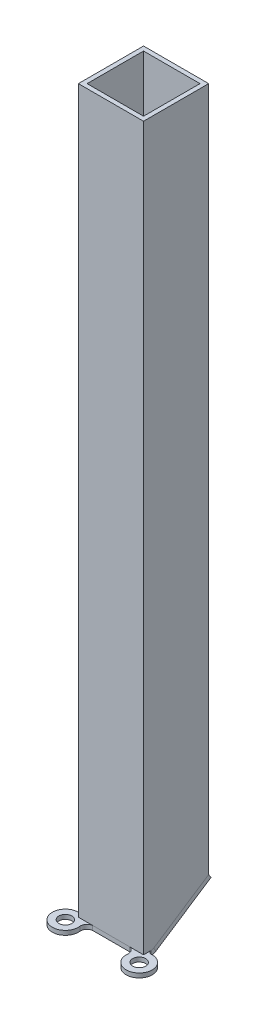
ISO-10303-21;
HEADER;
FILE_DESCRIPTION(('STEP AP214'),'2;1');
FILE_NAME('part.step','',(''),(''),'','','');
FILE_SCHEMA(('AUTOMOTIVE_DESIGN { 1 0 10303 214 1 1 1 1 }'));
ENDSEC;
DATA;
#1=APPLICATION_CONTEXT('core data for automotive mechanical design processes');
#2=APPLICATION_PROTOCOL_DEFINITION('international standard','automotive_design',2000,#1);
#3=PRODUCT_CONTEXT('',#1,'mechanical');
#4=PRODUCT('Part','Part','',(#3));
#5=PRODUCT_RELATED_PRODUCT_CATEGORY('part','',(#4));
#6=PRODUCT_DEFINITION_FORMATION('','',#4);
#7=PRODUCT_DEFINITION_CONTEXT('part definition',#1,'design');
#8=PRODUCT_DEFINITION('design','',#6,#7);
#9=PRODUCT_DEFINITION_SHAPE('','',#8);
#10=(LENGTH_UNIT() NAMED_UNIT(*) SI_UNIT(.MILLI.,.METRE.));
#11=(NAMED_UNIT(*) PLANE_ANGLE_UNIT() SI_UNIT($,.RADIAN.));
#12=(NAMED_UNIT(*) SI_UNIT($,.STERADIAN.) SOLID_ANGLE_UNIT());
#13=UNCERTAINTY_MEASURE_WITH_UNIT(LENGTH_MEASURE(1.E-05),#10,'distance_accuracy_value','');
#14=(GEOMETRIC_REPRESENTATION_CONTEXT(3) GLOBAL_UNCERTAINTY_ASSIGNED_CONTEXT((#13)) GLOBAL_UNIT_ASSIGNED_CONTEXT((#10,
#11,#12)) REPRESENTATION_CONTEXT('',''));
#15=CARTESIAN_POINT('',(0.,0.,0.));
#16=DIRECTION('',(0.,0.,1.));
#17=DIRECTION('',(1.,0.,0.));
#18=AXIS2_PLACEMENT_3D('',#15,#16,#17);
#19=CARTESIAN_POINT('',(1005.,-334.43981096134,434.283231707318));
#20=DIRECTION('',(0.,0.,1.));
#21=DIRECTION('',(1.,0.,0.));
#22=AXIS2_PLACEMENT_3D('',#19,#20,#21);
#23=PLANE('',#22);
#24=DIRECTION('',(1.,0.,0.));
#25=VECTOR('',#24,1.);
#26=CARTESIAN_POINT('',(1005.,-332.43981096134,434.283231707318));
#27=LINE('',#26,#25);
#28=CARTESIAN_POINT('',(1011.5,-332.43981096134,434.283231707318));
#29=VERTEX_POINT('',#28);
#30=CARTESIAN_POINT('',(1028.5,-332.43981096134,434.283231707318));
#31=VERTEX_POINT('',#30);
#32=EDGE_CURVE('E145',#29,#31,#27,.T.);
#33=ORIENTED_EDGE('',*,*,#32,.F.);
#34=DIRECTION('',(0.,-1.,0.));
#35=VECTOR('',#34,1.);
#36=CARTESIAN_POINT('',(1011.5,-332.43981096134,434.283231707318));
#37=LINE('',#36,#35);
#38=CARTESIAN_POINT('',(1011.5,-334.43981096134,434.283231707318));
#39=VERTEX_POINT('',#38);
#40=EDGE_CURVE('E309',#29,#39,#37,.T.);
#41=ORIENTED_EDGE('',*,*,#40,.T.);
#42=DIRECTION('',(1.,0.,0.));
#43=VECTOR('',#42,1.);
#44=CARTESIAN_POINT('',(1005.,-334.43981096134,434.283231707318));
#45=LINE('',#44,#43);
#46=CARTESIAN_POINT('',(1028.5,-334.43981096134,434.283231707318));
#47=VERTEX_POINT('',#46);
#48=EDGE_CURVE('E184',#39,#47,#45,.T.);
#49=ORIENTED_EDGE('',*,*,#48,.T.);
#50=DIRECTION('',(0.,-1.,0.));
#51=VECTOR('',#50,1.);
#52=CARTESIAN_POINT('',(1028.5,-332.43981096134,434.283231707318));
#53=LINE('',#52,#51);
#54=EDGE_CURVE('E235',#31,#47,#53,.T.);
#55=ORIENTED_EDGE('',*,*,#54,.F.);
#56=EDGE_LOOP('',(#33,#41,#49,#55));
#57=FACE_BOUND('',#56,.T.);
#58=ADVANCED_FACE('F66',(#57),#23,.T.);
#59=CARTESIAN_POINT('',(1035.,-334.43981096134,430.113764924496));
#60=DIRECTION('',(-1.,0.,0.));
#61=DIRECTION('',(0.,0.,1.));
#62=AXIS2_PLACEMENT_3D('',#59,#60,#61);
#63=PLANE('',#62);
#64=DIRECTION('',(0.,0.,1.));
#65=VECTOR('',#64,1.);
#66=CARTESIAN_POINT('',(1035.,-332.43981096134,430.113764924496));
#67=LINE('',#66,#65);
#68=CARTESIAN_POINT('',(1035.,-332.43981096134,430.712849211409));
#69=VERTEX_POINT('',#68);
#70=CARTESIAN_POINT('',(1035.,-332.43981096134,430.79991693377));
#71=VERTEX_POINT('',#70);
#72=EDGE_CURVE('E113',#69,#71,#67,.T.);
#73=ORIENTED_EDGE('',*,*,#72,.T.);
#74=DIRECTION('',(0.,-1.,0.));
#75=VECTOR('',#74,1.);
#76=CARTESIAN_POINT('',(1035.,-332.43981096134,430.79991693377));
#77=LINE('',#76,#75);
#78=CARTESIAN_POINT('',(1035.,-334.43981096134,430.79991693377));
#79=VERTEX_POINT('',#78);
#80=EDGE_CURVE('E153',#71,#79,#77,.T.);
#81=ORIENTED_EDGE('',*,*,#80,.T.);
#82=DIRECTION('',(0.,0.,1.));
#83=VECTOR('',#82,1.);
#84=CARTESIAN_POINT('',(1035.,-334.43981096134,430.113764924496));
#85=LINE('',#84,#83);
#86=CARTESIAN_POINT('',(1035.,-334.43981096134,430.712849211409));
#87=VERTEX_POINT('',#86);
#88=EDGE_CURVE('E116',#87,#79,#85,.T.);
#89=ORIENTED_EDGE('',*,*,#88,.F.);
#90=DIRECTION('',(0.,-1.,0.));
#91=VECTOR('',#90,1.);
#92=CARTESIAN_POINT('',(1035.,-334.43981096134,430.712849211409));
#93=LINE('',#92,#91);
#94=EDGE_CURVE('E13',#69,#87,#93,.T.);
#95=ORIENTED_EDGE('',*,*,#94,.F.);
#96=EDGE_LOOP('',(#73,#81,#89,#95));
#97=FACE_BOUND('',#96,.T.);
#98=ADVANCED_FACE('F109',(#97),#63,.F.);
#99=CARTESIAN_POINT('',(1005.,-334.43981096134,430.113764924496));
#100=DIRECTION('',(-1.,0.,0.));
#101=DIRECTION('',(0.,0.,1.));
#102=AXIS2_PLACEMENT_3D('',#99,#100,#101);
#103=PLANE('',#102);
#104=DIRECTION('',(0.,-1.,0.));
#105=VECTOR('',#104,1.);
#106=CARTESIAN_POINT('',(1005.,-332.43981096134,430.79991693377));
#107=LINE('',#106,#105);
#108=CARTESIAN_POINT('',(1005.,-332.43981096134,430.79991693377));
#109=VERTEX_POINT('',#108);
#110=CARTESIAN_POINT('',(1005.,-334.43981096134,430.79991693377));
#111=VERTEX_POINT('',#110);
#112=EDGE_CURVE('E304',#109,#111,#107,.T.);
#113=ORIENTED_EDGE('',*,*,#112,.F.);
#114=DIRECTION('',(0.,0.,1.));
#115=VECTOR('',#114,1.);
#116=CARTESIAN_POINT('',(1005.,-332.43981096134,430.113764924496));
#117=LINE('',#116,#115);
#118=CARTESIAN_POINT('',(1005.,-332.43981096134,430.712849211409));
#119=VERTEX_POINT('',#118);
#120=EDGE_CURVE('E172',#119,#109,#117,.T.);
#121=ORIENTED_EDGE('',*,*,#120,.F.);
#122=DIRECTION('',(0.,-1.,0.));
#123=VECTOR('',#122,1.);
#124=CARTESIAN_POINT('',(1005.,-334.43981096134,430.712849211409));
#125=LINE('',#124,#123);
#126=CARTESIAN_POINT('',(1005.,-334.43981096134,430.712849211409));
#127=VERTEX_POINT('',#126);
#128=EDGE_CURVE('E76',#119,#127,#125,.T.);
#129=ORIENTED_EDGE('',*,*,#128,.T.);
#130=DIRECTION('',(0.,0.,1.));
#131=VECTOR('',#130,1.);
#132=CARTESIAN_POINT('',(1005.,-334.43981096134,430.113764924496));
#133=LINE('',#132,#131);
#134=EDGE_CURVE('E171',#127,#111,#133,.T.);
#135=ORIENTED_EDGE('',*,*,#134,.T.);
#136=EDGE_LOOP('',(#113,#121,#129,#135));
#137=FACE_BOUND('',#136,.T.);
#138=ADVANCED_FACE('F169',(#137),#103,.T.);
#139=CARTESIAN_POINT('',(1005.,-330.43981096134,430.712849211409));
#140=DIRECTION('',(1.,0.,0.));
#141=DIRECTION('',(0.,0.,-1.));
#142=AXIS2_PLACEMENT_3D('',#139,#140,#141);
#143=PLANE('',#142);
#144=ORIENTED_EDGE('',*,*,#128,.F.);
#145=CARTESIAN_POINT('',(1005.,-330.43981096134,430.712849211409));
#146=DIRECTION('',(1.,0.,0.));
#147=DIRECTION('',(0.,0.,-1.));
#148=AXIS2_PLACEMENT_3D('',#145,#146,#147);
#149=CIRCLE('',#148,2.);
#150=CARTESIAN_POINT('',(1005.,-332.110460143872,429.613335087396));
#151=VERTEX_POINT('',#150);
#152=EDGE_CURVE('E131',#119,#151,#149,.T.);
#153=ORIENTED_EDGE('',*,*,#152,.T.);
#154=DIRECTION('',(0.,-0.835324591266377,-0.549757062006174));
#155=VECTOR('',#154,1.);
#156=CARTESIAN_POINT('',(1005.,-333.781109326405,428.513820963384));
#157=LINE('',#156,#155);
#158=CARTESIAN_POINT('',(1005.,-333.781109326405,428.513820963384));
#159=VERTEX_POINT('',#158);
#160=EDGE_CURVE('E84',#151,#159,#157,.T.);
#161=ORIENTED_EDGE('',*,*,#160,.T.);
#162=CARTESIAN_POINT('',(1005.,-330.43981096134,430.712849211409));
#163=DIRECTION('',(-1.,0.,0.));
#164=DIRECTION('',(0.,0.,1.));
#165=AXIS2_PLACEMENT_3D('',#162,#163,#164);
#166=CIRCLE('',#165,4.);
#167=EDGE_CURVE('E186',#127,#159,#166,.F.);
#168=ORIENTED_EDGE('',*,*,#167,.F.);
#169=EDGE_LOOP('',(#144,#153,#161,#168));
#170=FACE_BOUND('',#169,.T.);
#171=ADVANCED_FACE('F187',(#170),#143,.F.);
#172=CARTESIAN_POINT('',(1005.,-334.110460143872,429.014250800484));
#173=DIRECTION('',(-1.,0.,0.));
#174=DIRECTION('',(0.,-0.549757062006174,0.835324591266377));
#175=AXIS2_PLACEMENT_3D('',#172,#173,#174);
#176=PLANE('',#175);
#177=ORIENTED_EDGE('',*,*,#160,.F.);
#178=DIRECTION('',(0.,-0.549757062006174,0.835324591266377));
#179=VECTOR('',#178,1.);
#180=CARTESIAN_POINT('',(1005.,-332.43981096134,430.113764924496));
#181=LINE('',#180,#179);
#182=CARTESIAN_POINT('',(1005.,-315.43981096134,404.283231707318));
#183=VERTEX_POINT('',#182);
#184=EDGE_CURVE('E208',#183,#151,#181,.T.);
#185=ORIENTED_EDGE('',*,*,#184,.F.);
#186=DIRECTION('',(0.,-0.835324591266377,-0.549757062006174));
#187=VECTOR('',#186,1.);
#188=CARTESIAN_POINT('',(1005.,-317.110460143872,403.183717583306));
#189=LINE('',#188,#187);
#190=CARTESIAN_POINT('',(1005.,-317.110460143872,403.183717583306));
#191=VERTEX_POINT('',#190);
#192=EDGE_CURVE('E160',#183,#191,#189,.T.);
#193=ORIENTED_EDGE('',*,*,#192,.T.);
#194=DIRECTION('',(0.,-0.549757062006174,0.835324591266377));
#195=VECTOR('',#194,1.);
#196=CARTESIAN_POINT('',(1005.,-334.110460143872,429.014250800484));
#197=LINE('',#196,#195);
#198=EDGE_CURVE('E200',#191,#159,#197,.T.);
#199=ORIENTED_EDGE('',*,*,#198,.T.);
#200=EDGE_LOOP('',(#177,#185,#193,#199));
#201=FACE_BOUND('',#200,.T.);
#202=ADVANCED_FACE('F253',(#201),#176,.T.);
#203=CARTESIAN_POINT('',(1005.,-317.110460143872,403.183717583306));
#204=DIRECTION('',(0.,-0.549757062006174,0.835324591266377));
#205=DIRECTION('',(1.,0.,0.));
#206=AXIS2_PLACEMENT_3D('',#203,#204,#205);
#207=PLANE('',#206);
#208=ORIENTED_EDGE('',*,*,#192,.F.);
#209=DIRECTION('',(1.,0.,0.));
#210=VECTOR('',#209,1.);
#211=CARTESIAN_POINT('',(1005.,-315.43981096134,404.283231707318));
#212=LINE('',#211,#210);
#213=CARTESIAN_POINT('',(1035.,-315.43981096134,404.283231707318));
#214=VERTEX_POINT('',#213);
#215=EDGE_CURVE('E136',#183,#214,#212,.T.);
#216=ORIENTED_EDGE('',*,*,#215,.T.);
#217=DIRECTION('',(0.,-0.835324591266377,-0.549757062006174));
#218=VECTOR('',#217,1.);
#219=CARTESIAN_POINT('',(1035.,-317.110460143872,403.183717583306));
#220=LINE('',#219,#218);
#221=CARTESIAN_POINT('',(1035.,-317.110460143872,403.183717583306));
#222=VERTEX_POINT('',#221);
#223=EDGE_CURVE('E157',#214,#222,#220,.T.);
#224=ORIENTED_EDGE('',*,*,#223,.T.);
#225=DIRECTION('',(1.,0.,0.));
#226=VECTOR('',#225,1.);
#227=CARTESIAN_POINT('',(1005.,-317.110460143872,403.183717583306));
#228=LINE('',#227,#226);
#229=EDGE_CURVE('E195',#191,#222,#228,.T.);
#230=ORIENTED_EDGE('',*,*,#229,.F.);
#231=EDGE_LOOP('',(#208,#216,#224,#230));
#232=FACE_BOUND('',#231,.T.);
#233=ADVANCED_FACE('F361',(#232),#207,.F.);
#234=CARTESIAN_POINT('',(1035.,-334.110460143872,429.014250800484));
#235=DIRECTION('',(-1.,0.,0.));
#236=DIRECTION('',(0.,-0.549757062006174,0.835324591266377));
#237=AXIS2_PLACEMENT_3D('',#234,#235,#236);
#238=PLANE('',#237);
#239=ORIENTED_EDGE('',*,*,#223,.F.);
#240=DIRECTION('',(0.,-0.549757062006174,0.835324591266377));
#241=VECTOR('',#240,1.);
#242=CARTESIAN_POINT('',(1035.,-332.43981096134,430.113764924496));
#243=LINE('',#242,#241);
#244=CARTESIAN_POINT('',(1035.,-332.110460143873,429.613335087396));
#245=VERTEX_POINT('',#244);
#246=EDGE_CURVE('E206',#214,#245,#243,.T.);
#247=ORIENTED_EDGE('',*,*,#246,.T.);
#248=DIRECTION('',(0.,-0.835324591266377,-0.549757062006173));
#249=VECTOR('',#248,1.);
#250=CARTESIAN_POINT('',(1035.,-333.781109326405,428.513820963384));
#251=LINE('',#250,#249);
#252=CARTESIAN_POINT('',(1035.,-333.781109326405,428.513820963384));
#253=VERTEX_POINT('',#252);
#254=EDGE_CURVE('E70',#245,#253,#251,.T.);
#255=ORIENTED_EDGE('',*,*,#254,.T.);
#256=DIRECTION('',(0.,-0.549757062006174,0.835324591266377));
#257=VECTOR('',#256,1.);
#258=CARTESIAN_POINT('',(1035.,-334.110460143872,429.014250800484));
#259=LINE('',#258,#257);
#260=EDGE_CURVE('E183',#222,#253,#259,.T.);
#261=ORIENTED_EDGE('',*,*,#260,.F.);
#262=EDGE_LOOP('',(#239,#247,#255,#261));
#263=FACE_BOUND('',#262,.T.);
#264=ADVANCED_FACE('F261',(#263),#238,.F.);
#265=CARTESIAN_POINT('',(1035.,-330.43981096134,430.712849211409));
#266=DIRECTION('',(-1.,0.,0.));
#267=DIRECTION('',(0.,0.,1.));
#268=AXIS2_PLACEMENT_3D('',#265,#266,#267);
#269=PLANE('',#268);
#270=CARTESIAN_POINT('',(1035.,-330.43981096134,430.712849211409));
#271=DIRECTION('',(1.,0.,0.));
#272=DIRECTION('',(0.,0.,-1.));
#273=AXIS2_PLACEMENT_3D('',#270,#271,#272);
#274=CIRCLE('',#273,2.);
#275=EDGE_CURVE('E129',#245,#69,#274,.F.);
#276=ORIENTED_EDGE('',*,*,#275,.T.);
#277=ORIENTED_EDGE('',*,*,#94,.T.);
#278=CARTESIAN_POINT('',(1035.,-330.43981096134,430.712849211409));
#279=DIRECTION('',(1.,0.,0.));
#280=DIRECTION('',(0.,0.,-1.));
#281=AXIS2_PLACEMENT_3D('',#278,#279,#280);
#282=CIRCLE('',#281,4.);
#283=EDGE_CURVE('E191',#253,#87,#282,.F.);
#284=ORIENTED_EDGE('',*,*,#283,.F.);
#285=ORIENTED_EDGE('',*,*,#254,.F.);
#286=EDGE_LOOP('',(#276,#277,#284,#285));
#287=FACE_BOUND('',#286,.T.);
#288=ADVANCED_FACE('F68',(#287),#269,.F.);
#289=CARTESIAN_POINT('',(1005.,-334.110460143872,429.014250800484));
#290=DIRECTION('',(0.,0.835324591266377,0.549757062006174));
#291=DIRECTION('',(0.,-0.549757062006174,0.835324591266377));
#292=AXIS2_PLACEMENT_3D('',#289,#290,#291);
#293=PLANE('',#292);
#294=ORIENTED_EDGE('',*,*,#260,.T.);
#295=DIRECTION('',(1.,0.,0.));
#296=VECTOR('',#295,1.);
#297=CARTESIAN_POINT('',(1005.,-333.781109326405,428.513820963384));
#298=LINE('',#297,#296);
#299=EDGE_CURVE('E194',#253,#159,#298,.F.);
#300=ORIENTED_EDGE('',*,*,#299,.T.);
#301=ORIENTED_EDGE('',*,*,#198,.F.);
#302=ORIENTED_EDGE('',*,*,#229,.T.);
#303=EDGE_LOOP('',(#294,#300,#301,#302));
#304=FACE_BOUND('',#303,.T.);
#305=ADVANCED_FACE('F257',(#304),#293,.F.);
#306=CARTESIAN_POINT('',(1005.,-334.43981096134,430.113764924496));
#307=DIRECTION('',(0.,1.,0.));
#308=DIRECTION('',(0.,0.,1.));
#309=AXIS2_PLACEMENT_3D('',#306,#307,#308);
#310=PLANE('',#309);
#311=ORIENTED_EDGE('',*,*,#48,.F.);
#312=CARTESIAN_POINT('',(1011.94057532168,-334.43981096134,437.250704265898));
#313=DIRECTION('',(0.,-1.,0.));
#314=DIRECTION('',(0.,0.,-1.));
#315=AXIS2_PLACEMENT_3D('',#312,#313,#314);
#316=CIRCLE('',#315,2.99999999999996);
#317=CARTESIAN_POINT('',(1008.96038354779,-334.43981096134,437.594880079705));
#318=VERTEX_POINT('',#317);
#319=EDGE_CURVE('E390',#318,#39,#316,.T.);
#320=ORIENTED_EDGE('',*,*,#319,.F.);
#321=CARTESIAN_POINT('',(1003.,-334.43981096134,438.283231707318));
#322=DIRECTION('',(0.,-1.,0.));
#323=DIRECTION('',(0.,0.,-1.));
#324=AXIS2_PLACEMENT_3D('',#321,#322,#323);
#325=CIRCLE('',#324,6.00000000000001);
#326=CARTESIAN_POINT('',(1003.4,-334.43981096134,432.29657988848));
#327=VERTEX_POINT('',#326);
#328=EDGE_CURVE('E392',#318,#327,#325,.T.);
#329=ORIENTED_EDGE('',*,*,#328,.T.);
#330=CARTESIAN_POINT('',(1003.5,-334.43981096134,430.79991693377));
#331=DIRECTION('',(0.,-1.,0.));
#332=DIRECTION('',(0.,0.,-1.));
#333=AXIS2_PLACEMENT_3D('',#330,#331,#332);
#334=CIRCLE('',#333,1.50000000000003);
#335=EDGE_CURVE('E182',#111,#327,#334,.T.);
#336=ORIENTED_EDGE('',*,*,#335,.F.);
#337=ORIENTED_EDGE('',*,*,#134,.F.);
#338=DIRECTION('',(1.,0.,0.));
#339=VECTOR('',#338,1.);
#340=CARTESIAN_POINT('',(1005.,-334.43981096134,430.712849211409));
#341=LINE('',#340,#339);
#342=EDGE_CURVE('E179',#127,#87,#341,.T.);
#343=ORIENTED_EDGE('',*,*,#342,.T.);
#344=ORIENTED_EDGE('',*,*,#88,.T.);
#345=CARTESIAN_POINT('',(1036.5,-334.43981096134,430.79991693377));
#346=DIRECTION('',(0.,-1.,0.));
#347=DIRECTION('',(0.,0.,-1.));
#348=AXIS2_PLACEMENT_3D('',#345,#346,#347);
#349=CIRCLE('',#348,1.50000000000003);
#350=CARTESIAN_POINT('',(1036.6,-334.43981096134,432.29657988848));
#351=VERTEX_POINT('',#350);
#352=EDGE_CURVE('E329',#79,#351,#349,.F.);
#353=ORIENTED_EDGE('',*,*,#352,.T.);
#354=CARTESIAN_POINT('',(1037.,-334.43981096134,438.283231707318));
#355=DIRECTION('',(0.,-1.,0.));
#356=DIRECTION('',(0.,0.,-1.));
#357=AXIS2_PLACEMENT_3D('',#354,#355,#356);
#358=CIRCLE('',#357,6.00000000000001);
#359=CARTESIAN_POINT('',(1031.03961645221,-334.43981096134,437.594880079705));
#360=VERTEX_POINT('',#359);
#361=EDGE_CURVE('E324',#360,#351,#358,.F.);
#362=ORIENTED_EDGE('',*,*,#361,.F.);
#363=CARTESIAN_POINT('',(1028.05942467832,-334.43981096134,437.250704265898));
#364=DIRECTION('',(0.,-1.,0.));
#365=DIRECTION('',(0.,0.,-1.));
#366=AXIS2_PLACEMENT_3D('',#363,#364,#365);
#367=CIRCLE('',#366,2.99999999999996);
#368=EDGE_CURVE('E327',#360,#47,#367,.F.);
#369=ORIENTED_EDGE('',*,*,#368,.T.);
#370=EDGE_LOOP('',(#311,#320,#329,#336,#337,#343,#344,#353,#362,#369));
#371=FACE_BOUND('',#370,.T.);
#372=CARTESIAN_POINT('',(1037.,-334.43981096134,438.283231707318));
#373=DIRECTION('',(0.,-1.,0.));
#374=DIRECTION('',(0.,0.,-1.));
#375=AXIS2_PLACEMENT_3D('',#372,#373,#374);
#376=CIRCLE('',#375,2.99999999999993);
#377=CARTESIAN_POINT('',(1037.,-334.43981096134,435.283231707318));
#378=VERTEX_POINT('',#377);
#379=EDGE_CURVE('E319',#378,#378,#376,.F.);
#380=ORIENTED_EDGE('',*,*,#379,.T.);
#381=EDGE_LOOP('',(#380));
#382=FACE_BOUND('',#381,.T.);
#383=CARTESIAN_POINT('',(1003.,-334.43981096134,438.283231707318));
#384=DIRECTION('',(0.,-1.,0.));
#385=DIRECTION('',(0.,0.,-1.));
#386=AXIS2_PLACEMENT_3D('',#383,#384,#385);
#387=CIRCLE('',#386,2.99999999999993);
#388=CARTESIAN_POINT('',(1003.,-334.43981096134,435.283231707318));
#389=VERTEX_POINT('',#388);
#390=EDGE_CURVE('E307',#389,#389,#387,.T.);
#391=ORIENTED_EDGE('',*,*,#390,.F.);
#392=EDGE_LOOP('',(#391));
#393=FACE_BOUND('',#392,.T.);
#394=ADVANCED_FACE('F176',(#371,#382,#393),#310,.F.);
#395=CARTESIAN_POINT('',(1005.,-330.43981096134,430.712849211409));
#396=DIRECTION('',(1.,0.,0.));
#397=DIRECTION('',(0.,0.,-1.));
#398=AXIS2_PLACEMENT_3D('',#395,#396,#397);
#399=CYLINDRICAL_SURFACE('',#398,4.);
#400=ORIENTED_EDGE('',*,*,#167,.T.);
#401=ORIENTED_EDGE('',*,*,#299,.F.);
#402=ORIENTED_EDGE('',*,*,#283,.T.);
#403=ORIENTED_EDGE('',*,*,#342,.F.);
#404=EDGE_LOOP('',(#400,#401,#402,#403));
#405=FACE_BOUND('',#404,.T.);
#406=ADVANCED_FACE('F193',(#405),#399,.T.);
#407=CARTESIAN_POINT('',(1005.,-332.43981096134,430.113764924496));
#408=DIRECTION('',(0.,0.835324591266377,0.549757062006174));
#409=DIRECTION('',(0.,-0.549757062006174,0.835324591266377));
#410=AXIS2_PLACEMENT_3D('',#407,#408,#409);
#411=PLANE('',#410);
#412=ORIENTED_EDGE('',*,*,#246,.F.);
#413=ORIENTED_EDGE('',*,*,#215,.F.);
#414=ORIENTED_EDGE('',*,*,#184,.T.);
#415=DIRECTION('',(1.,0.,0.));
#416=VECTOR('',#415,1.);
#417=CARTESIAN_POINT('',(1005.,-332.110460143873,429.613335087396));
#418=LINE('',#417,#416);
#419=EDGE_CURVE('E135',#245,#151,#418,.F.);
#420=ORIENTED_EDGE('',*,*,#419,.F.);
#421=EDGE_LOOP('',(#412,#413,#414,#420));
#422=FACE_BOUND('',#421,.T.);
#423=ADVANCED_FACE('F371',(#422),#411,.T.);
#424=CARTESIAN_POINT('',(1005.,-332.43981096134,430.113764924496));
#425=DIRECTION('',(0.,1.,0.));
#426=DIRECTION('',(0.,0.,1.));
#427=AXIS2_PLACEMENT_3D('',#424,#425,#426);
#428=PLANE('',#427);
#429=CARTESIAN_POINT('',(1011.94057532168,-332.43981096134,437.250704265898));
#430=DIRECTION('',(0.,-1.,0.));
#431=DIRECTION('',(0.,0.,-1.));
#432=AXIS2_PLACEMENT_3D('',#429,#430,#431);
#433=CIRCLE('',#432,2.99999999999996);
#434=CARTESIAN_POINT('',(1008.96038354779,-332.43981096134,437.594880079705));
#435=VERTEX_POINT('',#434);
#436=EDGE_CURVE('E223',#435,#29,#433,.T.);
#437=ORIENTED_EDGE('',*,*,#436,.T.);
#438=ORIENTED_EDGE('',*,*,#32,.T.);
#439=CARTESIAN_POINT('',(1028.05942467832,-332.43981096134,437.250704265898));
#440=DIRECTION('',(0.,-1.,0.));
#441=DIRECTION('',(0.,0.,-1.));
#442=AXIS2_PLACEMENT_3D('',#439,#440,#441);
#443=CIRCLE('',#442,2.99999999999996);
#444=CARTESIAN_POINT('',(1031.03961645221,-332.43981096134,437.594880079705));
#445=VERTEX_POINT('',#444);
#446=EDGE_CURVE('E219',#445,#31,#443,.F.);
#447=ORIENTED_EDGE('',*,*,#446,.F.);
#448=CARTESIAN_POINT('',(1037.,-332.43981096134,438.283231707318));
#449=DIRECTION('',(0.,-1.,0.));
#450=DIRECTION('',(0.,0.,-1.));
#451=AXIS2_PLACEMENT_3D('',#448,#449,#450);
#452=CIRCLE('',#451,6.00000000000001);
#453=CARTESIAN_POINT('',(1036.6,-332.43981096134,432.29657988848));
#454=VERTEX_POINT('',#453);
#455=EDGE_CURVE('E240',#445,#454,#452,.F.);
#456=ORIENTED_EDGE('',*,*,#455,.T.);
#457=CARTESIAN_POINT('',(1036.5,-332.43981096134,430.79991693377));
#458=DIRECTION('',(0.,-1.,0.));
#459=DIRECTION('',(0.,0.,-1.));
#460=AXIS2_PLACEMENT_3D('',#457,#458,#459);
#461=CIRCLE('',#460,1.50000000000003);
#462=EDGE_CURVE('E144',#71,#454,#461,.F.);
#463=ORIENTED_EDGE('',*,*,#462,.F.);
#464=ORIENTED_EDGE('',*,*,#72,.F.);
#465=DIRECTION('',(1.,0.,0.));
#466=VECTOR('',#465,1.);
#467=CARTESIAN_POINT('',(1005.,-332.43981096134,430.712849211409));
#468=LINE('',#467,#466);
#469=EDGE_CURVE('E126',#119,#69,#468,.T.);
#470=ORIENTED_EDGE('',*,*,#469,.F.);
#471=ORIENTED_EDGE('',*,*,#120,.T.);
#472=CARTESIAN_POINT('',(1003.5,-332.43981096134,430.79991693377));
#473=DIRECTION('',(0.,-1.,0.));
#474=DIRECTION('',(0.,0.,-1.));
#475=AXIS2_PLACEMENT_3D('',#472,#473,#474);
#476=CIRCLE('',#475,1.50000000000003);
#477=CARTESIAN_POINT('',(1003.4,-332.43981096134,432.29657988848));
#478=VERTEX_POINT('',#477);
#479=EDGE_CURVE('E302',#109,#478,#476,.T.);
#480=ORIENTED_EDGE('',*,*,#479,.T.);
#481=CARTESIAN_POINT('',(1003.,-332.43981096134,438.283231707318));
#482=DIRECTION('',(0.,-1.,0.));
#483=DIRECTION('',(0.,0.,-1.));
#484=AXIS2_PLACEMENT_3D('',#481,#482,#483);
#485=CIRCLE('',#484,6.00000000000001);
#486=EDGE_CURVE('E315',#435,#478,#485,.T.);
#487=ORIENTED_EDGE('',*,*,#486,.F.);
#488=EDGE_LOOP('',(#437,#438,#447,#456,#463,#464,#470,#471,#480,#487));
#489=FACE_BOUND('',#488,.T.);
#490=CARTESIAN_POINT('',(1037.,-332.43981096134,438.283231707318));
#491=DIRECTION('',(0.,-1.,0.));
#492=DIRECTION('',(0.,0.,-1.));
#493=AXIS2_PLACEMENT_3D('',#490,#491,#492);
#494=CIRCLE('',#493,2.99999999999993);
#495=CARTESIAN_POINT('',(1037.,-332.43981096134,435.283231707318));
#496=VERTEX_POINT('',#495);
#497=EDGE_CURVE('E245',#496,#496,#494,.F.);
#498=ORIENTED_EDGE('',*,*,#497,.F.);
#499=EDGE_LOOP('',(#498));
#500=FACE_BOUND('',#499,.T.);
#501=CARTESIAN_POINT('',(1003.,-332.43981096134,438.283231707318));
#502=DIRECTION('',(0.,-1.,0.));
#503=DIRECTION('',(0.,0.,-1.));
#504=AXIS2_PLACEMENT_3D('',#501,#502,#503);
#505=CIRCLE('',#504,2.99999999999993);
#506=CARTESIAN_POINT('',(1003.,-332.43981096134,435.283231707318));
#507=VERTEX_POINT('',#506);
#508=EDGE_CURVE('E310',#507,#507,#505,.T.);
#509=ORIENTED_EDGE('',*,*,#508,.T.);
#510=EDGE_LOOP('',(#509));
#511=FACE_BOUND('',#510,.T.);
#512=ADVANCED_FACE('F140',(#489,#500,#511),#428,.T.);
#513=CARTESIAN_POINT('',(1005.,-330.43981096134,430.712849211409));
#514=DIRECTION('',(1.,0.,0.));
#515=DIRECTION('',(0.,0.,-1.));
#516=AXIS2_PLACEMENT_3D('',#513,#514,#515);
#517=CYLINDRICAL_SURFACE('',#516,2.);
#518=ORIENTED_EDGE('',*,*,#152,.F.);
#519=ORIENTED_EDGE('',*,*,#469,.T.);
#520=ORIENTED_EDGE('',*,*,#275,.F.);
#521=ORIENTED_EDGE('',*,*,#419,.T.);
#522=EDGE_LOOP('',(#518,#519,#520,#521));
#523=FACE_BOUND('',#522,.T.);
#524=ADVANCED_FACE('F127',(#523),#517,.F.);
#525=CARTESIAN_POINT('',(1037.,-332.43981096134,438.283231707318));
#526=DIRECTION('',(0.,-1.,0.));
#527=DIRECTION('',(0.,0.,-1.));
#528=AXIS2_PLACEMENT_3D('',#525,#526,#527);
#529=CYLINDRICAL_SURFACE('',#528,6.00000000000001);
#530=ORIENTED_EDGE('',*,*,#361,.T.);
#531=DIRECTION('',(0.,-1.,0.));
#532=VECTOR('',#531,1.);
#533=CARTESIAN_POINT('',(1036.6,-332.43981096134,432.29657988848));
#534=LINE('',#533,#532);
#535=EDGE_CURVE('E149',#454,#351,#534,.T.);
#536=ORIENTED_EDGE('',*,*,#535,.F.);
#537=ORIENTED_EDGE('',*,*,#455,.F.);
#538=DIRECTION('',(0.,-1.,0.));
#539=VECTOR('',#538,1.);
#540=CARTESIAN_POINT('',(1031.03961645221,-332.43981096134,437.594880079705));
#541=LINE('',#540,#539);
#542=EDGE_CURVE('E238',#445,#360,#541,.T.);
#543=ORIENTED_EDGE('',*,*,#542,.T.);
#544=EDGE_LOOP('',(#530,#536,#537,#543));
#545=FACE_BOUND('',#544,.T.);
#546=ADVANCED_FACE('F368',(#545),#529,.T.);
#547=CARTESIAN_POINT('',(1036.5,-332.43981096134,430.79991693377));
#548=DIRECTION('',(0.,-1.,0.));
#549=DIRECTION('',(0.,0.,-1.));
#550=AXIS2_PLACEMENT_3D('',#547,#548,#549);
#551=CYLINDRICAL_SURFACE('',#550,1.50000000000003);
#552=ORIENTED_EDGE('',*,*,#352,.F.);
#553=ORIENTED_EDGE('',*,*,#80,.F.);
#554=ORIENTED_EDGE('',*,*,#462,.T.);
#555=ORIENTED_EDGE('',*,*,#535,.T.);
#556=EDGE_LOOP('',(#552,#553,#554,#555));
#557=FACE_BOUND('',#556,.T.);
#558=ADVANCED_FACE('F346',(#557),#551,.F.);
#559=CARTESIAN_POINT('',(1028.05942467832,-332.43981096134,437.250704265898));
#560=DIRECTION('',(0.,-1.,0.));
#561=DIRECTION('',(0.,0.,-1.));
#562=AXIS2_PLACEMENT_3D('',#559,#560,#561);
#563=CYLINDRICAL_SURFACE('',#562,2.99999999999996);
#564=ORIENTED_EDGE('',*,*,#368,.F.);
#565=ORIENTED_EDGE('',*,*,#542,.F.);
#566=ORIENTED_EDGE('',*,*,#446,.T.);
#567=ORIENTED_EDGE('',*,*,#54,.T.);
#568=EDGE_LOOP('',(#564,#565,#566,#567));
#569=FACE_BOUND('',#568,.T.);
#570=ADVANCED_FACE('F233',(#569),#563,.F.);
#571=CARTESIAN_POINT('',(1037.,-332.43981096134,438.283231707318));
#572=DIRECTION('',(0.,-1.,0.));
#573=DIRECTION('',(0.,0.,-1.));
#574=AXIS2_PLACEMENT_3D('',#571,#572,#573);
#575=CYLINDRICAL_SURFACE('',#574,2.99999999999993);
#576=ORIENTED_EDGE('',*,*,#497,.T.);
#577=EDGE_LOOP('',(#576));
#578=FACE_BOUND('',#577,.T.);
#579=ORIENTED_EDGE('',*,*,#379,.F.);
#580=EDGE_LOOP('',(#579));
#581=FACE_BOUND('',#580,.T.);
#582=ADVANCED_FACE('F336',(#578,#581),#575,.F.);
#583=CARTESIAN_POINT('',(1003.5,-332.43981096134,430.79991693377));
#584=DIRECTION('',(0.,-1.,0.));
#585=DIRECTION('',(0.,0.,-1.));
#586=AXIS2_PLACEMENT_3D('',#583,#584,#585);
#587=CYLINDRICAL_SURFACE('',#586,1.50000000000003);
#588=ORIENTED_EDGE('',*,*,#335,.T.);
#589=DIRECTION('',(0.,-1.,0.));
#590=VECTOR('',#589,1.);
#591=CARTESIAN_POINT('',(1003.4,-332.43981096134,432.29657988848));
#592=LINE('',#591,#590);
#593=EDGE_CURVE('E305',#478,#327,#592,.T.);
#594=ORIENTED_EDGE('',*,*,#593,.F.);
#595=ORIENTED_EDGE('',*,*,#479,.F.);
#596=ORIENTED_EDGE('',*,*,#112,.T.);
#597=EDGE_LOOP('',(#588,#594,#595,#596));
#598=FACE_BOUND('',#597,.T.);
#599=ADVANCED_FACE('F303',(#598),#587,.F.);
#600=CARTESIAN_POINT('',(1003.,-332.43981096134,438.283231707318));
#601=DIRECTION('',(0.,-1.,0.));
#602=DIRECTION('',(0.,0.,-1.));
#603=AXIS2_PLACEMENT_3D('',#600,#601,#602);
#604=CYLINDRICAL_SURFACE('',#603,6.00000000000001);
#605=ORIENTED_EDGE('',*,*,#328,.F.);
#606=DIRECTION('',(0.,-1.,0.));
#607=VECTOR('',#606,1.);
#608=CARTESIAN_POINT('',(1008.96038354779,-332.43981096134,437.594880079705));
#609=LINE('',#608,#607);
#610=EDGE_CURVE('E312',#435,#318,#609,.T.);
#611=ORIENTED_EDGE('',*,*,#610,.F.);
#612=ORIENTED_EDGE('',*,*,#486,.T.);
#613=ORIENTED_EDGE('',*,*,#593,.T.);
#614=EDGE_LOOP('',(#605,#611,#612,#613));
#615=FACE_BOUND('',#614,.T.);
#616=ADVANCED_FACE('F344',(#615),#604,.T.);
#617=CARTESIAN_POINT('',(1011.94057532168,-332.43981096134,437.250704265898));
#618=DIRECTION('',(0.,-1.,0.));
#619=DIRECTION('',(0.,0.,-1.));
#620=AXIS2_PLACEMENT_3D('',#617,#618,#619);
#621=CYLINDRICAL_SURFACE('',#620,2.99999999999996);
#622=ORIENTED_EDGE('',*,*,#319,.T.);
#623=ORIENTED_EDGE('',*,*,#40,.F.);
#624=ORIENTED_EDGE('',*,*,#436,.F.);
#625=ORIENTED_EDGE('',*,*,#610,.T.);
#626=EDGE_LOOP('',(#622,#623,#624,#625));
#627=FACE_BOUND('',#626,.T.);
#628=ADVANCED_FACE('F401',(#627),#621,.F.);
#629=CARTESIAN_POINT('',(1003.,-332.43981096134,438.283231707318));
#630=DIRECTION('',(0.,-1.,0.));
#631=DIRECTION('',(0.,0.,-1.));
#632=AXIS2_PLACEMENT_3D('',#629,#630,#631);
#633=CYLINDRICAL_SURFACE('',#632,2.99999999999993);
#634=ORIENTED_EDGE('',*,*,#508,.F.);
#635=EDGE_LOOP('',(#634));
#636=FACE_BOUND('',#635,.T.);
#637=ORIENTED_EDGE('',*,*,#390,.T.);
#638=EDGE_LOOP('',(#637));
#639=FACE_BOUND('',#638,.T.);
#640=ADVANCED_FACE('F405',(#636,#639),#633,.F.);
#641=CLOSED_SHELL('',(#58,#98,#138,#171,#202,#233,#264,#288,#305,#394,#406,#423,#512,#524,#546,
#558,#570,#582,#599,#616,#628,#640));
#642=MANIFOLD_SOLID_BREP('B2',#641);
#643=CARTESIAN_POINT('',(1005.,-332.43981096134,404.283231707318));
#644=DIRECTION('',(1.,0.,0.));
#645=DIRECTION('',(0.,0.,-1.));
#646=AXIS2_PLACEMENT_3D('',#643,#644,#645);
#647=PLANE('',#646);
#648=DIRECTION('',(0.,0.549757062006172,-0.835324591266378));
#649=VECTOR('',#648,1.);
#650=CARTESIAN_POINT('',(1005.,-332.43981096134,430.113764924496));
#651=LINE('',#650,#649);
#652=CARTESIAN_POINT('',(1005.,-332.43981096134,430.113764924496));
#653=VERTEX_POINT('',#652);
#654=CARTESIAN_POINT('',(1005.,-315.43981096134,404.283231707318));
#655=VERTEX_POINT('',#654);
#656=EDGE_CURVE('E693',#653,#655,#651,.T.);
#657=ORIENTED_EDGE('',*,*,#656,.F.);
#658=DIRECTION('',(0.,0.,-1.));
#659=VECTOR('',#658,1.);
#660=CARTESIAN_POINT('',(1005.,-332.43981096134,404.283231707318));
#661=LINE('',#660,#659);
#662=CARTESIAN_POINT('',(1005.,-332.43981096134,434.283231707318));
#663=VERTEX_POINT('',#662);
#664=EDGE_CURVE('E702',#663,#653,#661,.T.);
#665=ORIENTED_EDGE('',*,*,#664,.F.);
#666=DIRECTION('',(0.,1.,0.));
#667=VECTOR('',#666,1.);
#668=CARTESIAN_POINT('',(1005.,-332.43981096134,434.283231707318));
#669=LINE('',#668,#667);
#670=CARTESIAN_POINT('',(1005.,0.,434.283231707318));
#671=VERTEX_POINT('',#670);
#672=EDGE_CURVE('E739',#663,#671,#669,.T.);
#673=ORIENTED_EDGE('',*,*,#672,.T.);
#674=DIRECTION('',(0.,0.,-1.));
#675=VECTOR('',#674,1.);
#676=CARTESIAN_POINT('',(1005.,0.,404.283231707318));
#677=LINE('',#676,#675);
#678=CARTESIAN_POINT('',(1005.,0.,404.283231707318));
#679=VERTEX_POINT('',#678);
#680=EDGE_CURVE('E730',#671,#679,#677,.T.);
#681=ORIENTED_EDGE('',*,*,#680,.T.);
#682=DIRECTION('',(0.,1.,0.));
#683=VECTOR('',#682,1.);
#684=CARTESIAN_POINT('',(1005.,-332.43981096134,404.283231707318));
#685=LINE('',#684,#683);
#686=EDGE_CURVE('E613',#655,#679,#685,.T.);
#687=ORIENTED_EDGE('',*,*,#686,.F.);
#688=EDGE_LOOP('',(#657,#665,#673,#681,#687));
#689=FACE_BOUND('',#688,.T.);
#690=ADVANCED_FACE('F605',(#689),#647,.F.);
#691=CARTESIAN_POINT('',(1035.,-332.43981096134,404.283231707318));
#692=DIRECTION('',(0.,0.,1.));
#693=DIRECTION('',(1.,0.,0.));
#694=AXIS2_PLACEMENT_3D('',#691,#692,#693);
#695=PLANE('',#694);
#696=DIRECTION('',(1.,0.,0.));
#697=VECTOR('',#696,1.);
#698=CARTESIAN_POINT('',(1005.,-315.43981096134,404.283231707318));
#699=LINE('',#698,#697);
#700=CARTESIAN_POINT('',(1035.,-315.43981096134,404.283231707318));
#701=VERTEX_POINT('',#700);
#702=EDGE_CURVE('E697',#655,#701,#699,.T.);
#703=ORIENTED_EDGE('',*,*,#702,.F.);
#704=ORIENTED_EDGE('',*,*,#686,.T.);
#705=DIRECTION('',(1.,0.,0.));
#706=VECTOR('',#705,1.);
#707=CARTESIAN_POINT('',(1035.,0.,404.283231707318));
#708=LINE('',#707,#706);
#709=CARTESIAN_POINT('',(1035.,0.,404.283231707318));
#710=VERTEX_POINT('',#709);
#711=EDGE_CURVE('E732',#679,#710,#708,.T.);
#712=ORIENTED_EDGE('',*,*,#711,.T.);
#713=DIRECTION('',(0.,1.,0.));
#714=VECTOR('',#713,1.);
#715=CARTESIAN_POINT('',(1035.,-332.43981096134,404.283231707318));
#716=LINE('',#715,#714);
#717=EDGE_CURVE('E744',#701,#710,#716,.T.);
#718=ORIENTED_EDGE('',*,*,#717,.F.);
#719=EDGE_LOOP('',(#703,#704,#712,#718));
#720=FACE_BOUND('',#719,.T.);
#721=ADVANCED_FACE('F787',(#720),#695,.F.);
#722=CARTESIAN_POINT('',(1035.,-332.43981096134,404.283231707318));
#723=DIRECTION('',(-1.,0.,0.));
#724=DIRECTION('',(0.,0.,1.));
#725=AXIS2_PLACEMENT_3D('',#722,#723,#724);
#726=PLANE('',#725);
#727=DIRECTION('',(0.,0.549757062006172,-0.835324591266378));
#728=VECTOR('',#727,1.);
#729=CARTESIAN_POINT('',(1035.,-332.43981096134,430.113764924496));
#730=LINE('',#729,#728);
#731=CARTESIAN_POINT('',(1035.,-332.43981096134,430.113764924496));
#732=VERTEX_POINT('',#731);
#733=EDGE_CURVE('E620',#732,#701,#730,.T.);
#734=ORIENTED_EDGE('',*,*,#733,.T.);
#735=ORIENTED_EDGE('',*,*,#717,.T.);
#736=DIRECTION('',(0.,0.,1.));
#737=VECTOR('',#736,1.);
#738=CARTESIAN_POINT('',(1035.,0.,404.283231707318));
#739=LINE('',#738,#737);
#740=CARTESIAN_POINT('',(1035.,0.,434.283231707318));
#741=VERTEX_POINT('',#740);
#742=EDGE_CURVE('E735',#710,#741,#739,.T.);
#743=ORIENTED_EDGE('',*,*,#742,.T.);
#744=DIRECTION('',(0.,1.,0.));
#745=VECTOR('',#744,1.);
#746=CARTESIAN_POINT('',(1035.,-332.43981096134,434.283231707318));
#747=LINE('',#746,#745);
#748=CARTESIAN_POINT('',(1035.,-332.43981096134,434.283231707318));
#749=VERTEX_POINT('',#748);
#750=EDGE_CURVE('E741',#749,#741,#747,.T.);
#751=ORIENTED_EDGE('',*,*,#750,.F.);
#752=DIRECTION('',(0.,0.,1.));
#753=VECTOR('',#752,1.);
#754=CARTESIAN_POINT('',(1035.,-332.43981096134,404.283231707318));
#755=LINE('',#754,#753);
#756=EDGE_CURVE('E706',#732,#749,#755,.T.);
#757=ORIENTED_EDGE('',*,*,#756,.F.);
#758=EDGE_LOOP('',(#734,#735,#743,#751,#757));
#759=FACE_BOUND('',#758,.T.);
#760=ADVANCED_FACE('F791',(#759),#726,.F.);
#761=CARTESIAN_POINT('',(1033.,-332.43981096134,406.283231707318));
#762=DIRECTION('',(-1.,0.,0.));
#763=DIRECTION('',(0.,0.,1.));
#764=AXIS2_PLACEMENT_3D('',#761,#762,#763);
#765=PLANE('',#764);
#766=DIRECTION('',(0.,1.,0.));
#767=VECTOR('',#766,1.);
#768=CARTESIAN_POINT('',(1033.,-332.43981096134,406.283231707318));
#769=LINE('',#768,#767);
#770=CARTESIAN_POINT('',(1033.,-316.756082666385,406.283231707318));
#771=VERTEX_POINT('',#770);
#772=CARTESIAN_POINT('',(1033.,0.,406.283231707318));
#773=VERTEX_POINT('',#772);
#774=EDGE_CURVE('E742',#771,#773,#769,.T.);
#775=ORIENTED_EDGE('',*,*,#774,.F.);
#776=DIRECTION('',(0.,-0.549757062006172,0.835324591266378));
#777=VECTOR('',#776,1.);
#778=CARTESIAN_POINT('',(1033.,-321.496220210408,413.485601135841));
#779=LINE('',#778,#777);
#780=CARTESIAN_POINT('',(1033.,-332.43981096134,430.113764924496));
#781=VERTEX_POINT('',#780);
#782=EDGE_CURVE('E721',#771,#781,#779,.T.);
#783=ORIENTED_EDGE('',*,*,#782,.T.);
#784=DIRECTION('',(0.,0.,1.));
#785=VECTOR('',#784,1.);
#786=CARTESIAN_POINT('',(1033.,-332.43981096134,406.283231707318));
#787=LINE('',#786,#785);
#788=CARTESIAN_POINT('',(1033.,-332.43981096134,432.283231707318));
#789=VERTEX_POINT('',#788);
#790=EDGE_CURVE('E738',#781,#789,#787,.T.);
#791=ORIENTED_EDGE('',*,*,#790,.T.);
#792=DIRECTION('',(0.,1.,0.));
#793=VECTOR('',#792,1.);
#794=CARTESIAN_POINT('',(1033.,-332.43981096134,432.283231707318));
#795=LINE('',#794,#793);
#796=CARTESIAN_POINT('',(1033.,0.,432.283231707318));
#797=VERTEX_POINT('',#796);
#798=EDGE_CURVE('E716',#789,#797,#795,.T.);
#799=ORIENTED_EDGE('',*,*,#798,.T.);
#800=DIRECTION('',(0.,0.,1.));
#801=VECTOR('',#800,1.);
#802=CARTESIAN_POINT('',(1033.,0.,406.283231707318));
#803=LINE('',#802,#801);
#804=EDGE_CURVE('E717',#773,#797,#803,.T.);
#805=ORIENTED_EDGE('',*,*,#804,.F.);
#806=EDGE_LOOP('',(#775,#783,#791,#799,#805));
#807=FACE_BOUND('',#806,.T.);
#808=ADVANCED_FACE('F607',(#807),#765,.T.);
#809=CARTESIAN_POINT('',(1007.,-332.43981096134,406.283231707318));
#810=DIRECTION('',(0.,0.,1.));
#811=DIRECTION('',(1.,0.,0.));
#812=AXIS2_PLACEMENT_3D('',#809,#810,#811);
#813=PLANE('',#812);
#814=DIRECTION('',(0.,1.,0.));
#815=VECTOR('',#814,1.);
#816=CARTESIAN_POINT('',(1007.,-332.43981096134,406.283231707318));
#817=LINE('',#816,#815);
#818=CARTESIAN_POINT('',(1007.,-316.756082666385,406.283231707318));
#819=VERTEX_POINT('',#818);
#820=CARTESIAN_POINT('',(1007.,0.,406.283231707318));
#821=VERTEX_POINT('',#820);
#822=EDGE_CURVE('E749',#819,#821,#817,.T.);
#823=ORIENTED_EDGE('',*,*,#822,.F.);
#824=DIRECTION('',(1.,0.,0.));
#825=VECTOR('',#824,1.);
#826=CARTESIAN_POINT('',(1007.,-316.756082666385,406.283231707318));
#827=LINE('',#826,#825);
#828=EDGE_CURVE('E757',#819,#771,#827,.T.);
#829=ORIENTED_EDGE('',*,*,#828,.T.);
#830=ORIENTED_EDGE('',*,*,#774,.T.);
#831=DIRECTION('',(1.,0.,0.));
#832=VECTOR('',#831,1.);
#833=CARTESIAN_POINT('',(1007.,0.,406.283231707318));
#834=LINE('',#833,#832);
#835=EDGE_CURVE('E720',#821,#773,#834,.T.);
#836=ORIENTED_EDGE('',*,*,#835,.F.);
#837=EDGE_LOOP('',(#823,#829,#830,#836));
#838=FACE_BOUND('',#837,.T.);
#839=ADVANCED_FACE('F756',(#838),#813,.T.);
#840=CARTESIAN_POINT('',(1007.,-332.43981096134,406.283231707318));
#841=DIRECTION('',(1.,0.,0.));
#842=DIRECTION('',(0.,0.,-1.));
#843=AXIS2_PLACEMENT_3D('',#840,#841,#842);
#844=PLANE('',#843);
#845=DIRECTION('',(0.,0.,-1.));
#846=VECTOR('',#845,1.);
#847=CARTESIAN_POINT('',(1007.,-332.43981096134,406.283231707318));
#848=LINE('',#847,#846);
#849=CARTESIAN_POINT('',(1007.,-332.43981096134,432.283231707318));
#850=VERTEX_POINT('',#849);
#851=CARTESIAN_POINT('',(1007.,-332.43981096134,430.113764924496));
#852=VERTEX_POINT('',#851);
#853=EDGE_CURVE('E711',#850,#852,#848,.T.);
#854=ORIENTED_EDGE('',*,*,#853,.T.);
#855=DIRECTION('',(0.,0.549757062006172,-0.835324591266378));
#856=VECTOR('',#855,1.);
#857=CARTESIAN_POINT('',(1007.,-321.496220210408,413.485601135841));
#858=LINE('',#857,#856);
#859=EDGE_CURVE('E696',#852,#819,#858,.T.);
#860=ORIENTED_EDGE('',*,*,#859,.T.);
#861=ORIENTED_EDGE('',*,*,#822,.T.);
#862=DIRECTION('',(0.,0.,-1.));
#863=VECTOR('',#862,1.);
#864=CARTESIAN_POINT('',(1007.,0.,406.283231707318));
#865=LINE('',#864,#863);
#866=CARTESIAN_POINT('',(1007.,0.,432.283231707318));
#867=VERTEX_POINT('',#866);
#868=EDGE_CURVE('E724',#867,#821,#865,.T.);
#869=ORIENTED_EDGE('',*,*,#868,.F.);
#870=DIRECTION('',(0.,1.,0.));
#871=VECTOR('',#870,1.);
#872=CARTESIAN_POINT('',(1007.,-332.43981096134,432.283231707318));
#873=LINE('',#872,#871);
#874=EDGE_CURVE('E668',#850,#867,#873,.T.);
#875=ORIENTED_EDGE('',*,*,#874,.F.);
#876=EDGE_LOOP('',(#854,#860,#861,#869,#875));
#877=FACE_BOUND('',#876,.T.);
#878=ADVANCED_FACE('F765',(#877),#844,.T.);
#879=CARTESIAN_POINT('',(0.,-332.439810961339,-85.6874510994396));
#880=DIRECTION('',(0.,-1.,0.));
#881=DIRECTION('',(0.,0.,-1.));
#882=AXIS2_PLACEMENT_3D('',#879,#880,#881);
#883=PLANE('',#882);
#884=ORIENTED_EDGE('',*,*,#664,.T.);
#885=DIRECTION('',(1.,0.,0.));
#886=VECTOR('',#885,1.);
#887=CARTESIAN_POINT('',(1005.,-332.43981096134,430.113764924496));
#888=LINE('',#887,#886);
#889=EDGE_CURVE('E690',#653,#852,#888,.T.);
#890=ORIENTED_EDGE('',*,*,#889,.T.);
#891=ORIENTED_EDGE('',*,*,#853,.F.);
#892=DIRECTION('',(-1.,0.,0.));
#893=VECTOR('',#892,1.);
#894=CARTESIAN_POINT('',(1007.,-332.43981096134,432.283231707318));
#895=LINE('',#894,#893);
#896=EDGE_CURVE('E707',#789,#850,#895,.T.);
#897=ORIENTED_EDGE('',*,*,#896,.F.);
#898=ORIENTED_EDGE('',*,*,#790,.F.);
#899=DIRECTION('',(1.,0.,0.));
#900=VECTOR('',#899,1.);
#901=CARTESIAN_POINT('',(0.,-332.43981096134,430.113764924496));
#902=LINE('',#901,#900);
#903=EDGE_CURVE('E64',#781,#732,#902,.T.);
#904=ORIENTED_EDGE('',*,*,#903,.T.);
#905=ORIENTED_EDGE('',*,*,#756,.T.);
#906=DIRECTION('',(-1.,0.,0.));
#907=VECTOR('',#906,1.);
#908=CARTESIAN_POINT('',(1035.,-332.43981096134,434.283231707318));
#909=LINE('',#908,#907);
#910=EDGE_CURVE('E628',#749,#663,#909,.T.);
#911=ORIENTED_EDGE('',*,*,#910,.T.);
#912=EDGE_LOOP('',(#884,#890,#891,#897,#898,#904,#905,#911));
#913=FACE_BOUND('',#912,.T.);
#914=ADVANCED_FACE('F705',(#913),#883,.T.);
#915=CARTESIAN_POINT('',(1007.,-332.43981096134,432.283231707318));
#916=DIRECTION('',(0.,0.,-1.));
#917=DIRECTION('',(-1.,0.,0.));
#918=AXIS2_PLACEMENT_3D('',#915,#916,#917);
#919=PLANE('',#918);
#920=DIRECTION('',(-1.,0.,0.));
#921=VECTOR('',#920,1.);
#922=CARTESIAN_POINT('',(1007.,0.,432.283231707318));
#923=LINE('',#922,#921);
#924=EDGE_CURVE('E727',#797,#867,#923,.T.);
#925=ORIENTED_EDGE('',*,*,#924,.F.);
#926=ORIENTED_EDGE('',*,*,#798,.F.);
#927=ORIENTED_EDGE('',*,*,#896,.T.);
#928=ORIENTED_EDGE('',*,*,#874,.T.);
#929=EDGE_LOOP('',(#925,#926,#927,#928));
#930=FACE_BOUND('',#929,.T.);
#931=ADVANCED_FACE('F774',(#930),#919,.T.);
#932=CARTESIAN_POINT('',(1035.,-332.43981096134,434.283231707318));
#933=DIRECTION('',(0.,0.,-1.));
#934=DIRECTION('',(-1.,0.,0.));
#935=AXIS2_PLACEMENT_3D('',#932,#933,#934);
#936=PLANE('',#935);
#937=DIRECTION('',(-1.,0.,0.));
#938=VECTOR('',#937,1.);
#939=CARTESIAN_POINT('',(1035.,0.,434.283231707318));
#940=LINE('',#939,#938);
#941=EDGE_CURVE('E661',#741,#671,#940,.T.);
#942=ORIENTED_EDGE('',*,*,#941,.T.);
#943=ORIENTED_EDGE('',*,*,#672,.F.);
#944=ORIENTED_EDGE('',*,*,#910,.F.);
#945=ORIENTED_EDGE('',*,*,#750,.T.);
#946=EDGE_LOOP('',(#942,#943,#944,#945));
#947=FACE_BOUND('',#946,.T.);
#948=ADVANCED_FACE('F776',(#947),#936,.F.);
#949=CARTESIAN_POINT('',(0.,6.10622663543836E-13,-85.6874510994396));
#950=DIRECTION('',(0.,-1.,0.));
#951=DIRECTION('',(0.,0.,-1.));
#952=AXIS2_PLACEMENT_3D('',#949,#950,#951);
#953=PLANE('',#952);
#954=ORIENTED_EDGE('',*,*,#804,.T.);
#955=ORIENTED_EDGE('',*,*,#924,.T.);
#956=ORIENTED_EDGE('',*,*,#868,.T.);
#957=ORIENTED_EDGE('',*,*,#835,.T.);
#958=EDGE_LOOP('',(#954,#955,#956,#957));
#959=FACE_BOUND('',#958,.T.);
#960=ORIENTED_EDGE('',*,*,#680,.F.);
#961=ORIENTED_EDGE('',*,*,#941,.F.);
#962=ORIENTED_EDGE('',*,*,#742,.F.);
#963=ORIENTED_EDGE('',*,*,#711,.F.);
#964=EDGE_LOOP('',(#960,#961,#962,#963));
#965=FACE_BOUND('',#964,.T.);
#966=ADVANCED_FACE('F763',(#959,#965),#953,.F.);
#967=CARTESIAN_POINT('',(1005.,-332.43981096134,430.113764924496));
#968=DIRECTION('',(0.,-0.835324591266378,-0.549757062006172));
#969=DIRECTION('',(0.,0.549757062006172,-0.835324591266378));
#970=AXIS2_PLACEMENT_3D('',#967,#968,#969);
#971=PLANE('',#970);
#972=ORIENTED_EDGE('',*,*,#828,.F.);
#973=ORIENTED_EDGE('',*,*,#859,.F.);
#974=ORIENTED_EDGE('',*,*,#889,.F.);
#975=ORIENTED_EDGE('',*,*,#656,.T.);
#976=ORIENTED_EDGE('',*,*,#702,.T.);
#977=ORIENTED_EDGE('',*,*,#733,.F.);
#978=ORIENTED_EDGE('',*,*,#903,.F.);
#979=ORIENTED_EDGE('',*,*,#782,.F.);
#980=EDGE_LOOP('',(#972,#973,#974,#975,#976,#977,#978,#979));
#981=FACE_BOUND('',#980,.T.);
#982=ADVANCED_FACE('F692',(#981),#971,.T.);
#983=CLOSED_SHELL('',(#690,#721,#760,#808,#839,#878,#914,#931,#948,#966,#982));
#984=MANIFOLD_SOLID_BREP('B7',#983);
#985=ADVANCED_BREP_SHAPE_REPRESENTATION('',(#18,#642,#984),#14);
#986=SHAPE_DEFINITION_REPRESENTATION(#9,#985);
ENDSEC;
END-ISO-10303-21;
